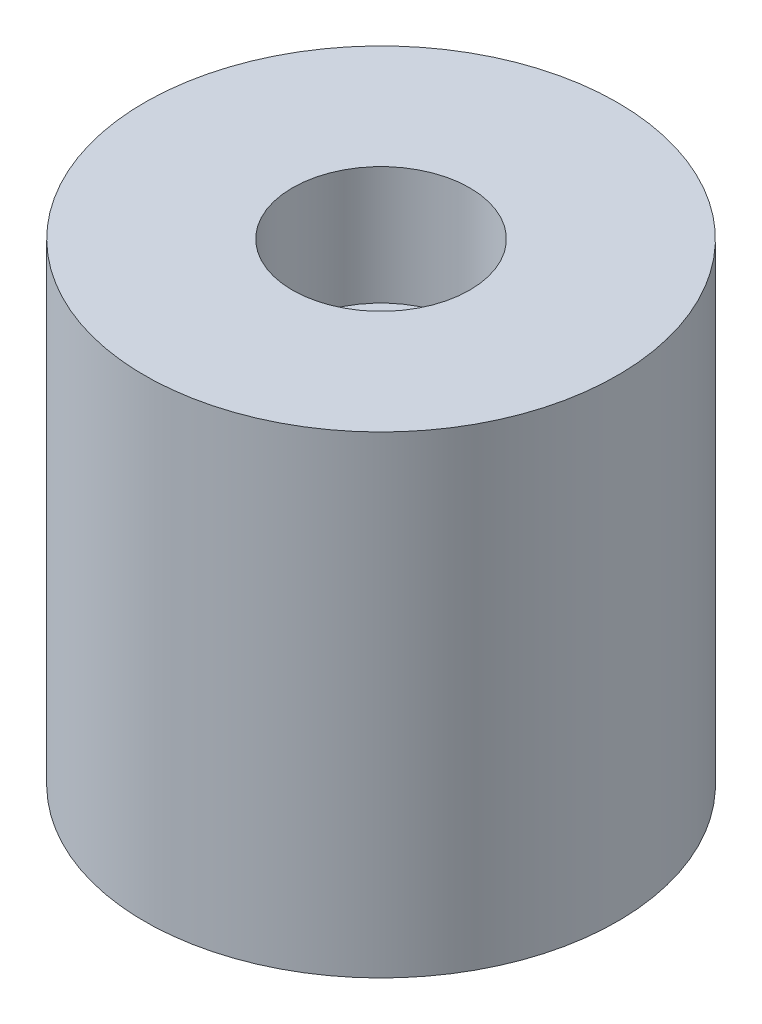
ISO-10303-21;
HEADER;
FILE_DESCRIPTION(('STEP AP214'),'2;1');
FILE_NAME('part.step','',(''),(''),'','','');
FILE_SCHEMA(('AUTOMOTIVE_DESIGN { 1 0 10303 214 1 1 1 1 }'));
ENDSEC;
DATA;
#1=APPLICATION_CONTEXT('core data for automotive mechanical design processes');
#2=APPLICATION_PROTOCOL_DEFINITION('international standard','automotive_design',2000,#1);
#3=PRODUCT_CONTEXT('',#1,'mechanical');
#4=PRODUCT('Part','Part','',(#3));
#5=PRODUCT_RELATED_PRODUCT_CATEGORY('part','',(#4));
#6=PRODUCT_DEFINITION_FORMATION('','',#4);
#7=PRODUCT_DEFINITION_CONTEXT('part definition',#1,'design');
#8=PRODUCT_DEFINITION('design','',#6,#7);
#9=PRODUCT_DEFINITION_SHAPE('','',#8);
#10=(LENGTH_UNIT() NAMED_UNIT(*) SI_UNIT(.MILLI.,.METRE.));
#11=(NAMED_UNIT(*) PLANE_ANGLE_UNIT() SI_UNIT($,.RADIAN.));
#12=(NAMED_UNIT(*) SI_UNIT($,.STERADIAN.) SOLID_ANGLE_UNIT());
#13=UNCERTAINTY_MEASURE_WITH_UNIT(LENGTH_MEASURE(1.E-05),#10,'distance_accuracy_value','');
#14=(GEOMETRIC_REPRESENTATION_CONTEXT(3) GLOBAL_UNCERTAINTY_ASSIGNED_CONTEXT((#13)) GLOBAL_UNIT_ASSIGNED_CONTEXT((#10,
#11,#12)) REPRESENTATION_CONTEXT('',''));
#15=CARTESIAN_POINT('',(0.,0.,0.));
#16=DIRECTION('',(0.,0.,1.));
#17=DIRECTION('',(1.,0.,0.));
#18=AXIS2_PLACEMENT_3D('',#15,#16,#17);
#19=CARTESIAN_POINT('',(0.,12.7,0.));
#20=DIRECTION('',(0.,-1.,0.));
#21=DIRECTION('',(0.,0.,-1.));
#22=AXIS2_PLACEMENT_3D('',#19,#20,#21);
#23=PLANE('',#22);
#24=CARTESIAN_POINT('',(0.,12.7,0.));
#25=DIRECTION('',(0.,-1.,0.));
#26=DIRECTION('',(0.,0.,-1.));
#27=AXIS2_PLACEMENT_3D('',#24,#25,#26);
#28=CIRCLE('',#27,12.7);
#29=CARTESIAN_POINT('',(0.,12.7,-12.7));
#30=VERTEX_POINT('',#29);
#31=EDGE_CURVE('E54',#30,#30,#28,.T.);
#32=ORIENTED_EDGE('',*,*,#31,.F.);
#33=EDGE_LOOP('',(#32));
#34=FACE_BOUND('',#33,.T.);
#35=CARTESIAN_POINT('',(0.,12.7,0.));
#36=DIRECTION('',(0.,-1.,0.));
#37=DIRECTION('',(0.,0.,-1.));
#38=AXIS2_PLACEMENT_3D('',#35,#36,#37);
#39=CIRCLE('',#38,4.7625);
#40=CARTESIAN_POINT('',(0.,12.7,-4.7625));
#41=VERTEX_POINT('',#40);
#42=EDGE_CURVE('E10',#41,#41,#39,.T.);
#43=ORIENTED_EDGE('',*,*,#42,.T.);
#44=EDGE_LOOP('',(#43));
#45=FACE_BOUND('',#44,.T.);
#46=ADVANCED_FACE('F32',(#34,#45),#23,.F.);
#47=CARTESIAN_POINT('',(0.,0.,0.));
#48=DIRECTION('',(0.,-1.,0.));
#49=DIRECTION('',(0.,0.,-1.));
#50=AXIS2_PLACEMENT_3D('',#47,#48,#49);
#51=CYLINDRICAL_SURFACE('',#50,4.7625);
#52=CARTESIAN_POINT('',(0.,6.35,0.));
#53=DIRECTION('',(0.,-1.,0.));
#54=DIRECTION('',(0.,0.,-1.));
#55=AXIS2_PLACEMENT_3D('',#52,#53,#54);
#56=CIRCLE('',#55,4.7625);
#57=CARTESIAN_POINT('',(0.,6.35,-4.7625));
#58=VERTEX_POINT('',#57);
#59=EDGE_CURVE('E38',#58,#58,#56,.T.);
#60=ORIENTED_EDGE('',*,*,#59,.T.);
#61=EDGE_LOOP('',(#60));
#62=FACE_BOUND('',#61,.T.);
#63=ORIENTED_EDGE('',*,*,#42,.F.);
#64=EDGE_LOOP('',(#63));
#65=FACE_BOUND('',#64,.T.);
#66=ADVANCED_FACE('F62',(#62,#65),#51,.F.);
#67=CARTESIAN_POINT('',(0.,6.35,0.));
#68=DIRECTION('',(0.,-1.,0.));
#69=DIRECTION('',(0.,0.,-1.));
#70=AXIS2_PLACEMENT_3D('',#67,#68,#69);
#71=PLANE('',#70);
#72=ORIENTED_EDGE('',*,*,#59,.F.);
#73=EDGE_LOOP('',(#72));
#74=FACE_BOUND('',#73,.T.);
#75=CARTESIAN_POINT('',(0.,6.35,0.));
#76=DIRECTION('',(0.,-1.,0.));
#77=DIRECTION('',(0.,0.,-1.));
#78=AXIS2_PLACEMENT_3D('',#75,#76,#77);
#79=CIRCLE('',#78,1.984375);
#80=CARTESIAN_POINT('',(0.,6.35,-1.984375));
#81=VERTEX_POINT('',#80);
#82=EDGE_CURVE('E42',#81,#81,#79,.T.);
#83=ORIENTED_EDGE('',*,*,#82,.T.);
#84=EDGE_LOOP('',(#83));
#85=FACE_BOUND('',#84,.T.);
#86=ADVANCED_FACE('F66',(#74,#85),#71,.F.);
#87=CARTESIAN_POINT('',(0.,0.,0.));
#88=DIRECTION('',(0.,-1.,0.));
#89=DIRECTION('',(0.,0.,-1.));
#90=AXIS2_PLACEMENT_3D('',#87,#88,#89);
#91=CYLINDRICAL_SURFACE('',#90,1.984375);
#92=ORIENTED_EDGE('',*,*,#82,.F.);
#93=EDGE_LOOP('',(#92));
#94=FACE_BOUND('',#93,.T.);
#95=CARTESIAN_POINT('',(0.,-12.7,0.));
#96=DIRECTION('',(0.,-1.,0.));
#97=DIRECTION('',(0.,0.,-1.));
#98=AXIS2_PLACEMENT_3D('',#95,#96,#97);
#99=CIRCLE('',#98,1.984375);
#100=CARTESIAN_POINT('',(0.,-12.7,-1.984375));
#101=VERTEX_POINT('',#100);
#102=EDGE_CURVE('E46',#101,#101,#99,.T.);
#103=ORIENTED_EDGE('',*,*,#102,.T.);
#104=EDGE_LOOP('',(#103));
#105=FACE_BOUND('',#104,.T.);
#106=ADVANCED_FACE('F70',(#94,#105),#91,.F.);
#107=CARTESIAN_POINT('',(0.,-12.7,0.));
#108=DIRECTION('',(0.,-1.,0.));
#109=DIRECTION('',(0.,0.,-1.));
#110=AXIS2_PLACEMENT_3D('',#107,#108,#109);
#111=PLANE('',#110);
#112=CARTESIAN_POINT('',(0.,-12.7,0.));
#113=DIRECTION('',(0.,-1.,0.));
#114=DIRECTION('',(0.,0.,-1.));
#115=AXIS2_PLACEMENT_3D('',#112,#113,#114);
#116=CIRCLE('',#115,12.7);
#117=CARTESIAN_POINT('',(0.,-12.7,-12.7));
#118=VERTEX_POINT('',#117);
#119=EDGE_CURVE('E51',#118,#118,#116,.T.);
#120=ORIENTED_EDGE('',*,*,#119,.T.);
#121=EDGE_LOOP('',(#120));
#122=FACE_BOUND('',#121,.T.);
#123=ORIENTED_EDGE('',*,*,#102,.F.);
#124=EDGE_LOOP('',(#123));
#125=FACE_BOUND('',#124,.T.);
#126=ADVANCED_FACE('F77',(#122,#125),#111,.T.);
#127=CARTESIAN_POINT('',(0.,0.,0.));
#128=DIRECTION('',(0.,-1.,0.));
#129=DIRECTION('',(0.,0.,-1.));
#130=AXIS2_PLACEMENT_3D('',#127,#128,#129);
#131=CYLINDRICAL_SURFACE('',#130,12.7);
#132=ORIENTED_EDGE('',*,*,#31,.T.);
#133=EDGE_LOOP('',(#132));
#134=FACE_BOUND('',#133,.T.);
#135=ORIENTED_EDGE('',*,*,#119,.F.);
#136=EDGE_LOOP('',(#135));
#137=FACE_BOUND('',#136,.T.);
#138=ADVANCED_FACE('F58',(#134,#137),#131,.T.);
#139=CLOSED_SHELL('',(#46,#66,#86,#106,#126,#138));
#140=MANIFOLD_SOLID_BREP('B2',#139);
#141=ADVANCED_BREP_SHAPE_REPRESENTATION('',(#18,#140),#14);
#142=SHAPE_DEFINITION_REPRESENTATION(#9,#141);
ENDSEC;
END-ISO-10303-21;
